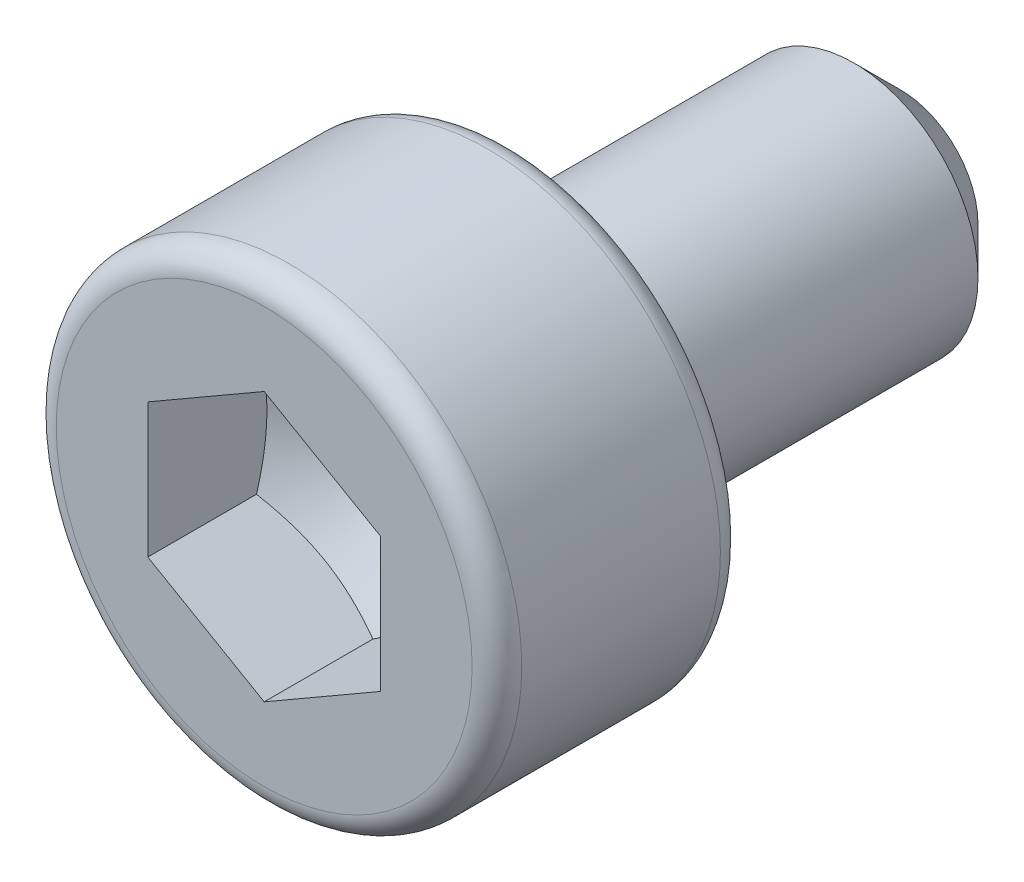
ISO-10303-21;
HEADER;
FILE_DESCRIPTION(('STEP AP214'),'2;1');
FILE_NAME('part.step','',(''),(''),'','','');
FILE_SCHEMA(('AUTOMOTIVE_DESIGN { 1 0 10303 214 1 1 1 1 }'));
ENDSEC;
DATA;
#1=APPLICATION_CONTEXT('core data for automotive mechanical design processes');
#2=APPLICATION_PROTOCOL_DEFINITION('international standard','automotive_design',2000,#1);
#3=PRODUCT_CONTEXT('',#1,'mechanical');
#4=PRODUCT('Part','Part','',(#3));
#5=PRODUCT_RELATED_PRODUCT_CATEGORY('part','',(#4));
#6=PRODUCT_DEFINITION_FORMATION('','',#4);
#7=PRODUCT_DEFINITION_CONTEXT('part definition',#1,'design');
#8=PRODUCT_DEFINITION('design','',#6,#7);
#9=PRODUCT_DEFINITION_SHAPE('','',#8);
#10=(LENGTH_UNIT() NAMED_UNIT(*) SI_UNIT(.MILLI.,.METRE.));
#11=(NAMED_UNIT(*) PLANE_ANGLE_UNIT() SI_UNIT($,.RADIAN.));
#12=(NAMED_UNIT(*) SI_UNIT($,.STERADIAN.) SOLID_ANGLE_UNIT());
#13=UNCERTAINTY_MEASURE_WITH_UNIT(LENGTH_MEASURE(1.E-05),#10,'distance_accuracy_value','');
#14=(GEOMETRIC_REPRESENTATION_CONTEXT(3) GLOBAL_UNCERTAINTY_ASSIGNED_CONTEXT((#13)) GLOBAL_UNIT_ASSIGNED_CONTEXT((#10,
#11,#12)) REPRESENTATION_CONTEXT('',''));
#15=CARTESIAN_POINT('',(0.,0.,0.));
#16=DIRECTION('',(0.,0.,1.));
#17=DIRECTION('',(1.,0.,0.));
#18=AXIS2_PLACEMENT_3D('',#15,#16,#17);
#19=CARTESIAN_POINT('',(0.75,0.433012701892214,-0.7));
#20=DIRECTION('',(0.5,0.866025403784439,0.));
#21=DIRECTION('',(-0.866025403784439,0.5,0.));
#22=AXIS2_PLACEMENT_3D('',#19,#20,#21);
#23=PLANE('',#22);
#24=CARTESIAN_POINT('',(0.7502,0.432897231838376,-0.700366099578617));
#25=CARTESIAN_POINT('',(0.717238666576004,0.451927466563569,-0.711360746831433));
#26=CARTESIAN_POINT('',(0.68399281869625,0.471121965786383,-0.721360638407276));
#27=CARTESIAN_POINT('',(0.616925218141244,0.509843463020717,-0.738817067650763));
#28=CARTESIAN_POINT('',(0.583102272153655,0.529371149991438,-0.746267427247854));
#29=CARTESIAN_POINT('',(0.515875632570364,0.568184468451565,-0.757867075837582));
#30=CARTESIAN_POINT('',(0.482482293499615,0.587464121753203,-0.762093531371977));
#31=CARTESIAN_POINT('',(0.415538173911307,0.626114327218175,-0.76714263363017));
#32=CARTESIAN_POINT('',(0.381987637355589,0.645484738530075,-0.767969457642672));
#33=CARTESIAN_POINT('',(0.319275698978885,0.681691493033268,-0.766266011537088));
#34=CARTESIAN_POINT('',(0.290104995811375,0.698533206359481,-0.764154000203301));
#35=CARTESIAN_POINT('',(0.231953671848459,0.732106888903204,-0.757454991772677));
#36=CARTESIAN_POINT('',(0.202973252776875,0.74883874165541,-0.752865697623372));
#37=CARTESIAN_POINT('',(0.144701650655193,0.782481866826474,-0.741390782696407));
#38=CARTESIAN_POINT('',(0.115417857581381,0.799388872640533,-0.734456431907052));
#39=CARTESIAN_POINT('',(0.057287489583832,0.83295045625201,-0.718717401982477));
#40=CARTESIAN_POINT('',(0.0284401676519287,0.849605465334794,-0.709916430390586));
#41=CARTESIAN_POINT('',(-0.000200000000000016,0.866140873838271,-0.700366099578618));
#42=B_SPLINE_CURVE_WITH_KNOTS('',3,(#24,#25,#26,#27,#28,#29,#30,#31,#32,#33,#34,#35,#36,#37,#38,
#39,#40,#41),.UNSPECIFIED.,.F.,.F.,(4,2,2,2,2,2,2,2,4),(0.,0.118896819359341,0.238079744533804,
0.3543117194564,0.470400831872514,0.571553114284104,0.672799351342654,0.776293900714048,
0.879584779344049),.UNSPECIFIED.);
#43=CARTESIAN_POINT('',(0.75,0.433012701892214,-0.700432779576839));
#44=VERTEX_POINT('',#43);
#45=CARTESIAN_POINT('',(0.,0.866025403784433,-0.700432779576841));
#46=VERTEX_POINT('',#45);
#47=EDGE_CURVE('E52',#44,#46,#42,.T.);
#48=ORIENTED_EDGE('',*,*,#47,.F.);
#49=DIRECTION('',(0.,0.,1.));
#50=VECTOR('',#49,1.);
#51=CARTESIAN_POINT('',(0.75,0.433012701892214,-0.7));
#52=LINE('',#51,#50);
#53=CARTESIAN_POINT('',(0.75,0.433012701892214,0.));
#54=VERTEX_POINT('',#53);
#55=EDGE_CURVE('E221',#44,#54,#52,.T.);
#56=ORIENTED_EDGE('',*,*,#55,.T.);
#57=DIRECTION('',(-0.866025403784439,0.5,0.));
#58=VECTOR('',#57,1.);
#59=CARTESIAN_POINT('',(0.75,0.433012701892214,0.));
#60=LINE('',#59,#58);
#61=CARTESIAN_POINT('',(0.,0.866025403784433,0.));
#62=VERTEX_POINT('',#61);
#63=EDGE_CURVE('E102',#54,#62,#60,.T.);
#64=ORIENTED_EDGE('',*,*,#63,.T.);
#65=DIRECTION('',(0.,0.,1.));
#66=VECTOR('',#65,1.);
#67=CARTESIAN_POINT('',(0.,0.866025403784433,-0.7));
#68=LINE('',#67,#66);
#69=EDGE_CURVE('E222',#46,#62,#68,.T.);
#70=ORIENTED_EDGE('',*,*,#69,.F.);
#71=EDGE_LOOP('',(#48,#56,#64,#70));
#72=FACE_BOUND('',#71,.T.);
#73=ADVANCED_FACE('F37',(#72),#23,.F.);
#74=CARTESIAN_POINT('',(0.75,-0.433012701892225,-0.7));
#75=DIRECTION('',(1.,0.,0.));
#76=DIRECTION('',(0.,1.,0.));
#77=AXIS2_PLACEMENT_3D('',#74,#75,#76);
#78=PLANE('',#77);
#79=CARTESIAN_POINT('',(0.75,-1.12155003345512,-0.421464556531514));
#80=CARTESIAN_POINT('',(0.75,-1.0891575863158,-0.437007760833722));
#81=CARTESIAN_POINT('',(0.75,-1.0566867101702,-0.452386791286091));
#82=CARTESIAN_POINT('',(0.75,-0.991545109192528,-0.482730542009868));
#83=CARTESIAN_POINT('',(0.75,-0.958874349677247,-0.497695187736947));
#84=CARTESIAN_POINT('',(0.75,-0.860122319737418,-0.542006550714751));
#85=CARTESIAN_POINT('',(0.75,-0.793688560891844,-0.570582270607276));
#86=CARTESIAN_POINT('',(0.75,-0.657750604094324,-0.625200540258185));
#87=CARTESIAN_POINT('',(0.75,-0.588211527649193,-0.65115746143929));
#88=CARTESIAN_POINT('',(0.75,-0.447342280020039,-0.697350174384806));
#89=CARTESIAN_POINT('',(0.75,-0.376017295183574,-0.717600819644571));
#90=CARTESIAN_POINT('',(0.75,-0.267595053569363,-0.741087338565405));
#91=CARTESIAN_POINT('',(0.75,-0.231252254589787,-0.747764688765423));
#92=CARTESIAN_POINT('',(0.75,-0.15815880213511,-0.758367954841571));
#93=CARTESIAN_POINT('',(0.75,-0.121408176416761,-0.762294056815491));
#94=CARTESIAN_POINT('',(0.75,-0.048143513360138,-0.767031193441621));
#95=CARTESIAN_POINT('',(0.75,-0.0116319194279316,-0.767878998462321));
#96=CARTESIAN_POINT('',(0.75,0.061330885556155,-0.766485938084743));
#97=CARTESIAN_POINT('',(0.75,0.0977820927322647,-0.764244881581513));
#98=CARTESIAN_POINT('',(0.75,0.18771472858449,-0.755102676497099));
#99=CARTESIAN_POINT('',(0.75,0.241022348242553,-0.746488069597163));
#100=CARTESIAN_POINT('',(0.75,0.346597186021325,-0.724270566086588));
#101=CARTESIAN_POINT('',(0.75,0.398863070071843,-0.710661658422512));
#102=CARTESIAN_POINT('',(0.75,0.503475749695101,-0.679558185145835));
#103=CARTESIAN_POINT('',(0.75,0.555798041750262,-0.661983277463112));
#104=CARTESIAN_POINT('',(0.75,0.659481603628858,-0.624296467544055));
#105=CARTESIAN_POINT('',(0.749999999999999,0.710843203382969,-0.604185455360141));
#106=CARTESIAN_POINT('',(0.749999999999999,0.841517438133812,-0.550432182430593));
#107=CARTESIAN_POINT('',(0.749999999999999,0.920310502489786,-0.515539069702119));
#108=CARTESIAN_POINT('',(0.749999999999999,1.07676574654142,-0.443300882841262));
#109=CARTESIAN_POINT('',(0.749999999999999,1.15442762953987,-0.405955179081599));
#110=CARTESIAN_POINT('',(0.749999999999999,1.30908252754072,-0.329689443703838));
#111=CARTESIAN_POINT('',(0.749999999999999,1.38607467053784,-0.290767650824091));
#112=CARTESIAN_POINT('',(0.749999999999999,1.53954340496616,-0.21191973582789));
#113=CARTESIAN_POINT('',(0.749999999999999,1.61601997925952,-0.17199358053249));
#114=CARTESIAN_POINT('',(0.749999999999999,1.76139915267478,-0.0952560505260022));
#115=CARTESIAN_POINT('',(0.749999999999999,1.8303346263369,-0.0585068223939873));
#116=CARTESIAN_POINT('',(0.749999999999999,1.96798380944957,0.0154101902594626));
#117=CARTESIAN_POINT('',(0.749999999999999,2.03669751056312,0.05257799028565));
#118=CARTESIAN_POINT('',(0.749999999999999,2.17377941736928,0.1271323530607));
#119=CARTESIAN_POINT('',(0.749999999999999,2.24214805728764,0.164518118346003));
#120=CARTESIAN_POINT('',(0.749999999999999,2.37874711178942,0.23953296786098));
#121=CARTESIAN_POINT('',(0.749999999999999,2.44697753342426,0.277162039245344));
#122=CARTESIAN_POINT('',(0.749999999999999,2.51515829702999,0.314880307887129));
#123=B_SPLINE_CURVE_WITH_KNOTS('',3,(#79,#80,#81,#82,#83,#84,#85,#86,#87,#88,#89,#90,#91,#92,
#93,#94,#95,#96,#97,#98,#99,#100,#101,#102,#103,#104,#105,#106,#107,#108,#109,#110,#111,#112,
#113,#114,#115,#116,#117,#118,#119,#120,#121,#122),.UNSPECIFIED.,.F.,.F.,(4,2,2,2,2,2,2,2,2,2,2,
2,2,2,2,2,2,2,2,2,2,4),(0.,0.10778396592653,0.215587196953586,0.432485275424467,
0.655046914009104,0.877023754828945,0.987790752529652,1.09855025709201,1.20798230045649,
1.31742111458229,1.47908393146278,1.64094196446713,1.80643212732748,1.9718643717858,
2.23030174361042,2.4888057226086,2.74760701145514,3.00641686101626,3.24077252120949,
3.47513689115394,3.70890481776016,3.94266050178766),.UNSPECIFIED.);
#124=CARTESIAN_POINT('',(0.75,-0.433012701892225,-0.700432779576836));
#125=VERTEX_POINT('',#124);
#126=EDGE_CURVE('E59',#125,#44,#123,.T.);
#127=ORIENTED_EDGE('',*,*,#126,.F.);
#128=DIRECTION('',(0.,0.,1.));
#129=VECTOR('',#128,1.);
#130=CARTESIAN_POINT('',(0.75,-0.433012701892225,-0.7));
#131=LINE('',#130,#129);
#132=CARTESIAN_POINT('',(0.75,-0.433012701892225,0.));
#133=VERTEX_POINT('',#132);
#134=EDGE_CURVE('E231',#125,#133,#131,.T.);
#135=ORIENTED_EDGE('',*,*,#134,.T.);
#136=DIRECTION('',(0.,1.,0.));
#137=VECTOR('',#136,1.);
#138=CARTESIAN_POINT('',(0.75,-0.433012701892225,0.));
#139=LINE('',#138,#137);
#140=EDGE_CURVE('E225',#133,#54,#139,.T.);
#141=ORIENTED_EDGE('',*,*,#140,.T.);
#142=ORIENTED_EDGE('',*,*,#55,.F.);
#143=EDGE_LOOP('',(#127,#135,#141,#142));
#144=FACE_BOUND('',#143,.T.);
#145=ADVANCED_FACE('F123',(#144),#78,.F.);
#146=CARTESIAN_POINT('',(0.,-0.866025403784444,-0.7));
#147=DIRECTION('',(0.5,-0.866025403784439,0.));
#148=DIRECTION('',(0.866025403784439,0.5,0.));
#149=AXIS2_PLACEMENT_3D('',#146,#147,#148);
#150=PLANE('',#149);
#151=CARTESIAN_POINT('',(-0.000200000000000435,-0.866140873838282,-0.700366099578612));
#152=CARTESIAN_POINT('',(0.0327613334239954,-0.847110639113089,-0.711360746831429));
#153=CARTESIAN_POINT('',(0.0660071813037501,-0.827916139890275,-0.721360638407271));
#154=CARTESIAN_POINT('',(0.133074781858756,-0.78919464265594,-0.738817067650758));
#155=CARTESIAN_POINT('',(0.166897727846346,-0.769666955685219,-0.74626742724785));
#156=CARTESIAN_POINT('',(0.234124367429638,-0.730853637225091,-0.757867075837577));
#157=CARTESIAN_POINT('',(0.267517706500387,-0.711573983923454,-0.762093531371972));
#158=CARTESIAN_POINT('',(0.334461826088695,-0.672923778458482,-0.767142633630165));
#159=CARTESIAN_POINT('',(0.368012362644414,-0.653553367146581,-0.767969457642667));
#160=CARTESIAN_POINT('',(0.430724301021118,-0.617346612643388,-0.766266011537082));
#161=CARTESIAN_POINT('',(0.459895004188627,-0.600504899317176,-0.764154000203295));
#162=CARTESIAN_POINT('',(0.518046328151544,-0.566931216773453,-0.757454991772672));
#163=CARTESIAN_POINT('',(0.547026747223126,-0.550199364021247,-0.752865697623366));
#164=CARTESIAN_POINT('',(0.605298349344808,-0.516556238850183,-0.741390782696401));
#165=CARTESIAN_POINT('',(0.63458214241862,-0.499649233036124,-0.734456431907047));
#166=CARTESIAN_POINT('',(0.692712510416168,-0.466087649424648,-0.718717401982472));
#167=CARTESIAN_POINT('',(0.721559832348071,-0.449432640341864,-0.709916430390581));
#168=CARTESIAN_POINT('',(0.7502,-0.432897231838387,-0.700366099578614));
#169=B_SPLINE_CURVE_WITH_KNOTS('',3,(#151,#152,#153,#154,#155,#156,#157,#158,#159,#160,#161,
#162,#163,#164,#165,#166,#167,#168),.UNSPECIFIED.,.F.,.F.,(4,2,2,2,2,2,2,2,4),(0.,
0.118896819359342,0.238079744533807,0.354311719456403,0.470400831872518,0.571553114284107,
0.672799351342657,0.776293900714049,0.87958477934405),.UNSPECIFIED.);
#170=CARTESIAN_POINT('',(0.,-0.866025403784444,-0.700432779576834));
#171=VERTEX_POINT('',#170);
#172=EDGE_CURVE('E100',#171,#125,#169,.T.);
#173=ORIENTED_EDGE('',*,*,#172,.F.);
#174=DIRECTION('',(0.,0.,1.));
#175=VECTOR('',#174,1.);
#176=CARTESIAN_POINT('',(0.,-0.866025403784444,-0.7));
#177=LINE('',#176,#175);
#178=CARTESIAN_POINT('',(0.,-0.866025403784444,0.));
#179=VERTEX_POINT('',#178);
#180=EDGE_CURVE('E229',#171,#179,#177,.T.);
#181=ORIENTED_EDGE('',*,*,#180,.T.);
#182=DIRECTION('',(0.866025403784439,0.5,0.));
#183=VECTOR('',#182,1.);
#184=CARTESIAN_POINT('',(0.,-0.866025403784444,0.));
#185=LINE('',#184,#183);
#186=EDGE_CURVE('E236',#179,#133,#185,.T.);
#187=ORIENTED_EDGE('',*,*,#186,.T.);
#188=ORIENTED_EDGE('',*,*,#134,.F.);
#189=EDGE_LOOP('',(#173,#181,#187,#188));
#190=FACE_BOUND('',#189,.T.);
#191=ADVANCED_FACE('F155',(#190),#150,.F.);
#192=CARTESIAN_POINT('',(-0.75,-0.433012701892225,-0.7));
#193=DIRECTION('',(-0.5,-0.866025403784439,0.));
#194=DIRECTION('',(0.866025403784439,-0.5,0.));
#195=AXIS2_PLACEMENT_3D('',#192,#193,#194);
#196=PLANE('',#195);
#197=CARTESIAN_POINT('',(-0.7502,-0.432897231838387,-0.700366099578614));
#198=CARTESIAN_POINT('',(-0.717238666576004,-0.45192746656358,-0.71136074683143));
#199=CARTESIAN_POINT('',(-0.68399281869625,-0.471121965786393,-0.721360638407272));
#200=CARTESIAN_POINT('',(-0.616925218141244,-0.509843463020728,-0.738817067650759));
#201=CARTESIAN_POINT('',(-0.583102272153654,-0.52937114999145,-0.74626742724785));
#202=CARTESIAN_POINT('',(-0.515875632570362,-0.568184468451577,-0.757867075837577));
#203=CARTESIAN_POINT('',(-0.482482293499613,-0.587464121753214,-0.762093531371973));
#204=CARTESIAN_POINT('',(-0.415538173911305,-0.626114327218186,-0.767142633630165));
#205=CARTESIAN_POINT('',(-0.381987637355586,-0.645484738530087,-0.767969457642667));
#206=CARTESIAN_POINT('',(-0.319275698978882,-0.68169149303328,-0.766266011537082));
#207=CARTESIAN_POINT('',(-0.290104995811373,-0.698533206359493,-0.764154000203295));
#208=CARTESIAN_POINT('',(-0.231953671848457,-0.732106888903215,-0.757454991772671));
#209=CARTESIAN_POINT('',(-0.202973252776874,-0.748838741655422,-0.752865697623366));
#210=CARTESIAN_POINT('',(-0.144701650655192,-0.782481866826485,-0.7413907826964));
#211=CARTESIAN_POINT('',(-0.11541785758138,-0.799388872640544,-0.734456431907045));
#212=CARTESIAN_POINT('',(-0.0572874895838315,-0.832950456252021,-0.718717401982471));
#213=CARTESIAN_POINT('',(-0.0284401676519284,-0.849605465334805,-0.70991643039058));
#214=CARTESIAN_POINT('',(0.000200000000000073,-0.866140873838282,-0.700366099578612));
#215=B_SPLINE_CURVE_WITH_KNOTS('',3,(#197,#198,#199,#200,#201,#202,#203,#204,#205,#206,#207,
#208,#209,#210,#211,#212,#213,#214),.UNSPECIFIED.,.F.,.F.,(4,2,2,2,2,2,2,2,4),(0.,
0.118896819359341,0.238079744533806,0.354311719456402,0.470400831872517,0.571553114284106,
0.672799351342656,0.776293900714049,0.87958477934405),.UNSPECIFIED.);
#216=CARTESIAN_POINT('',(-0.75,-0.433012701892225,-0.700432779576836));
#217=VERTEX_POINT('',#216);
#218=EDGE_CURVE('E104',#217,#171,#215,.T.);
#219=ORIENTED_EDGE('',*,*,#218,.F.);
#220=DIRECTION('',(0.,0.,1.));
#221=VECTOR('',#220,1.);
#222=CARTESIAN_POINT('',(-0.75,-0.433012701892225,-0.7));
#223=LINE('',#222,#221);
#224=CARTESIAN_POINT('',(-0.75,-0.433012701892225,0.));
#225=VERTEX_POINT('',#224);
#226=EDGE_CURVE('E227',#217,#225,#223,.T.);
#227=ORIENTED_EDGE('',*,*,#226,.T.);
#228=DIRECTION('',(0.866025403784439,-0.5,0.));
#229=VECTOR('',#228,1.);
#230=CARTESIAN_POINT('',(-0.75,-0.433012701892225,0.));
#231=LINE('',#230,#229);
#232=EDGE_CURVE('E239',#225,#179,#231,.T.);
#233=ORIENTED_EDGE('',*,*,#232,.T.);
#234=ORIENTED_EDGE('',*,*,#180,.F.);
#235=EDGE_LOOP('',(#219,#227,#233,#234));
#236=FACE_BOUND('',#235,.T.);
#237=ADVANCED_FACE('F151',(#236),#196,.F.);
#238=CARTESIAN_POINT('',(-0.75,0.433012701892214,-0.7));
#239=DIRECTION('',(-1.,0.,0.));
#240=DIRECTION('',(0.,-1.,0.));
#241=AXIS2_PLACEMENT_3D('',#238,#239,#240);
#242=PLANE('',#241);
#243=CARTESIAN_POINT('',(-0.75,-1.12155003345512,-0.421464556531514));
#244=CARTESIAN_POINT('',(-0.75,-1.0891575863158,-0.437007760833722));
#245=CARTESIAN_POINT('',(-0.75,-1.0566867101702,-0.452386791286091));
#246=CARTESIAN_POINT('',(-0.75,-0.991545109192528,-0.482730542009868));
#247=CARTESIAN_POINT('',(-0.75,-0.958874349677247,-0.497695187736947));
#248=CARTESIAN_POINT('',(-0.75,-0.860122319737418,-0.542006550714751));
#249=CARTESIAN_POINT('',(-0.75,-0.793688560891843,-0.570582270607276));
#250=CARTESIAN_POINT('',(-0.75,-0.657750604094323,-0.625200540258185));
#251=CARTESIAN_POINT('',(-0.75,-0.588211527649193,-0.65115746143929));
#252=CARTESIAN_POINT('',(-0.75,-0.447342280020039,-0.697350174384806));
#253=CARTESIAN_POINT('',(-0.75,-0.376017295183574,-0.717600819644571));
#254=CARTESIAN_POINT('',(-0.75,-0.267595053569363,-0.741087338565405));
#255=CARTESIAN_POINT('',(-0.75,-0.231252254589787,-0.747764688765423));
#256=CARTESIAN_POINT('',(-0.75,-0.15815880213511,-0.758367954841571));
#257=CARTESIAN_POINT('',(-0.75,-0.12140817641676,-0.762294056815491));
#258=CARTESIAN_POINT('',(-0.75,-0.0481435133601379,-0.76703119344162));
#259=CARTESIAN_POINT('',(-0.75,-0.0116319194279313,-0.767878998462321));
#260=CARTESIAN_POINT('',(-0.75,0.0613308855561553,-0.766485938084743));
#261=CARTESIAN_POINT('',(-0.75,0.097782092732265,-0.764244881581513));
#262=CARTESIAN_POINT('',(-0.75,0.18771472858449,-0.755102676497099));
#263=CARTESIAN_POINT('',(-0.75,0.241022348242553,-0.746488069597163));
#264=CARTESIAN_POINT('',(-0.75,0.346597186021325,-0.724270566086588));
#265=CARTESIAN_POINT('',(-0.75,0.398863070071843,-0.710661658422512));
#266=CARTESIAN_POINT('',(-0.75,0.503475749695102,-0.679558185145835));
#267=CARTESIAN_POINT('',(-0.75,0.555798041750263,-0.661983277463112));
#268=CARTESIAN_POINT('',(-0.75,0.659481603628858,-0.624296467544055));
#269=CARTESIAN_POINT('',(-0.75,0.710843203382969,-0.604185455360141));
#270=CARTESIAN_POINT('',(-0.75,0.841517438133812,-0.550432182430593));
#271=CARTESIAN_POINT('',(-0.75,0.920310502489786,-0.515539069702119));
#272=CARTESIAN_POINT('',(-0.75,1.07676574654142,-0.443300882841262));
#273=CARTESIAN_POINT('',(-0.75,1.15442762953987,-0.405955179081599));
#274=CARTESIAN_POINT('',(-0.75,1.30908252754072,-0.329689443703838));
#275=CARTESIAN_POINT('',(-0.75,1.38607467053784,-0.290767650824091));
#276=CARTESIAN_POINT('',(-0.75,1.53954340496616,-0.211919735827891));
#277=CARTESIAN_POINT('',(-0.749999999999999,1.61601997925952,-0.17199358053249));
#278=CARTESIAN_POINT('',(-0.749999999999999,1.76139915267478,-0.0952560505260029));
#279=CARTESIAN_POINT('',(-0.749999999999999,1.8303346263369,-0.058506822393988));
#280=CARTESIAN_POINT('',(-0.749999999999999,1.96798380944957,0.0154101902594622));
#281=CARTESIAN_POINT('',(-0.749999999999999,2.03669751056312,0.0525779902856498));
#282=CARTESIAN_POINT('',(-0.749999999999999,2.17377941736928,0.1271323530607));
#283=CARTESIAN_POINT('',(-0.749999999999999,2.24214805728764,0.164518118346003));
#284=CARTESIAN_POINT('',(-0.749999999999999,2.37874711178941,0.23953296786098));
#285=CARTESIAN_POINT('',(-0.749999999999999,2.44697753342426,0.277162039245344));
#286=CARTESIAN_POINT('',(-0.749999999999999,2.51515829702999,0.314880307887129));
#287=B_SPLINE_CURVE_WITH_KNOTS('',3,(#243,#244,#245,#246,#247,#248,#249,#250,#251,#252,#253,
#254,#255,#256,#257,#258,#259,#260,#261,#262,#263,#264,#265,#266,#267,#268,#269,#270,#271,#272,
#273,#274,#275,#276,#277,#278,#279,#280,#281,#282,#283,#284,#285,#286),.UNSPECIFIED.,.F.,.F.,(4,
2,2,2,2,2,2,2,2,2,2,2,2,2,2,2,2,2,2,2,2,4),(0.,0.10778396592653,0.215587196953586,
0.432485275424467,0.655046914009104,0.877023754828945,0.987790752529652,1.09855025709201,
1.20798230045649,1.31742111458229,1.47908393146278,1.64094196446713,1.80643212732748,
1.9718643717858,2.23030174361042,2.48880572260859,2.74760701145514,3.00641686101626,
3.24077252120949,3.47513689115394,3.70890481776016,3.94266050178766),.UNSPECIFIED.);
#288=CARTESIAN_POINT('',(-0.75,0.433012701892214,-0.700432779576839));
#289=VERTEX_POINT('',#288);
#290=EDGE_CURVE('E139',#289,#217,#287,.F.);
#291=ORIENTED_EDGE('',*,*,#290,.F.);
#292=DIRECTION('',(0.,0.,1.));
#293=VECTOR('',#292,1.);
#294=CARTESIAN_POINT('',(-0.75,0.433012701892214,-0.7));
#295=LINE('',#294,#293);
#296=CARTESIAN_POINT('',(-0.75,0.433012701892214,0.));
#297=VERTEX_POINT('',#296);
#298=EDGE_CURVE('E224',#289,#297,#295,.T.);
#299=ORIENTED_EDGE('',*,*,#298,.T.);
#300=DIRECTION('',(0.,-1.,0.));
#301=VECTOR('',#300,1.);
#302=CARTESIAN_POINT('',(-0.75,0.433012701892214,0.));
#303=LINE('',#302,#301);
#304=EDGE_CURVE('E242',#297,#225,#303,.T.);
#305=ORIENTED_EDGE('',*,*,#304,.T.);
#306=ORIENTED_EDGE('',*,*,#226,.F.);
#307=EDGE_LOOP('',(#291,#299,#305,#306));
#308=FACE_BOUND('',#307,.T.);
#309=ADVANCED_FACE('F154',(#308),#242,.F.);
#310=CARTESIAN_POINT('',(0.,0.866025403784433,-0.7));
#311=DIRECTION('',(-0.5,0.866025403784439,0.));
#312=DIRECTION('',(-0.866025403784439,-0.5,0.));
#313=AXIS2_PLACEMENT_3D('',#310,#311,#312);
#314=PLANE('',#313);
#315=CARTESIAN_POINT('',(0.000200000000000009,0.866140873838271,-0.700366099578618));
#316=CARTESIAN_POINT('',(-0.0327613334239954,0.847110639113078,-0.711360746831434));
#317=CARTESIAN_POINT('',(-0.0660071813037497,0.827916139890265,-0.721360638407277));
#318=CARTESIAN_POINT('',(-0.133074781858755,0.78919464265593,-0.738817067650764));
#319=CARTESIAN_POINT('',(-0.166897727846345,0.769666955685209,-0.746267427247855));
#320=CARTESIAN_POINT('',(-0.234124367429636,0.730853637225082,-0.757867075837582));
#321=CARTESIAN_POINT('',(-0.267517706500384,0.711573983923445,-0.762093531371977));
#322=CARTESIAN_POINT('',(-0.334461826088692,0.672923778458473,-0.76714263363017));
#323=CARTESIAN_POINT('',(-0.36801236264441,0.653553367146573,-0.767969457642672));
#324=CARTESIAN_POINT('',(-0.430724301021114,0.61734661264338,-0.766266011537088));
#325=CARTESIAN_POINT('',(-0.459895004188624,0.600504899317168,-0.7641540002033));
#326=CARTESIAN_POINT('',(-0.51804632815154,0.566931216773444,-0.757454991772677));
#327=CARTESIAN_POINT('',(-0.547026747223124,0.550199364021238,-0.752865697623371));
#328=CARTESIAN_POINT('',(-0.605298349344806,0.516556238850174,-0.741390782696406));
#329=CARTESIAN_POINT('',(-0.634582142418619,0.499649233036115,-0.734456431907051));
#330=CARTESIAN_POINT('',(-0.692712510416168,0.466087649424638,-0.718717401982476));
#331=CARTESIAN_POINT('',(-0.721559832348071,0.449432640341853,-0.709916430390585));
#332=CARTESIAN_POINT('',(-0.7502,0.432897231838376,-0.700366099578617));
#333=B_SPLINE_CURVE_WITH_KNOTS('',3,(#315,#316,#317,#318,#319,#320,#321,#322,#323,#324,#325,
#326,#327,#328,#329,#330,#331,#332),.UNSPECIFIED.,.F.,.F.,(4,2,2,2,2,2,2,2,4),(0.,
0.11889681935934,0.238079744533804,0.354311719456399,0.470400831872512,0.571553114284103,
0.672799351342654,0.776293900714048,0.87958477934405),.UNSPECIFIED.);
#334=EDGE_CURVE('E129',#46,#289,#333,.T.);
#335=ORIENTED_EDGE('',*,*,#334,.F.);
#336=ORIENTED_EDGE('',*,*,#69,.T.);
#337=DIRECTION('',(-0.866025403784439,-0.5,0.));
#338=VECTOR('',#337,1.);
#339=CARTESIAN_POINT('',(0.,0.866025403784433,0.));
#340=LINE('',#339,#338);
#341=EDGE_CURVE('E245',#62,#297,#340,.T.);
#342=ORIENTED_EDGE('',*,*,#341,.T.);
#343=ORIENTED_EDGE('',*,*,#298,.F.);
#344=EDGE_LOOP('',(#335,#336,#342,#343));
#345=FACE_BOUND('',#344,.T.);
#346=ADVANCED_FACE('F160',(#345),#314,.F.);
#347=CARTESIAN_POINT('',(0.,0.,0.));
#348=DIRECTION('',(0.,0.,-1.));
#349=DIRECTION('',(-1.,0.,0.));
#350=AXIS2_PLACEMENT_3D('',#347,#348,#349);
#351=PLANE('',#350);
#352=ORIENTED_EDGE('',*,*,#341,.F.);
#353=ORIENTED_EDGE('',*,*,#63,.F.);
#354=ORIENTED_EDGE('',*,*,#140,.F.);
#355=ORIENTED_EDGE('',*,*,#186,.F.);
#356=ORIENTED_EDGE('',*,*,#232,.F.);
#357=ORIENTED_EDGE('',*,*,#304,.F.);
#358=EDGE_LOOP('',(#352,#353,#354,#355,#356,#357));
#359=FACE_BOUND('',#358,.T.);
#360=CARTESIAN_POINT('',(0.,0.,0.));
#361=DIRECTION('',(0.,0.,-1.));
#362=DIRECTION('',(-1.,0.,0.));
#363=AXIS2_PLACEMENT_3D('',#360,#361,#362);
#364=CIRCLE('',#363,1.34);
#365=CARTESIAN_POINT('',(-1.34,0.,0.));
#366=VERTEX_POINT('',#365);
#367=EDGE_CURVE('E205',#366,#366,#364,.F.);
#368=ORIENTED_EDGE('',*,*,#367,.T.);
#369=EDGE_LOOP('',(#368));
#370=FACE_BOUND('',#369,.T.);
#371=ADVANCED_FACE('F164',(#359,#370),#351,.F.);
#372=CARTESIAN_POINT('',(0.,0.,0.));
#373=DIRECTION('',(0.,0.,1.));
#374=DIRECTION('',(1.,0.,0.));
#375=AXIS2_PLACEMENT_3D('',#372,#373,#374);
#376=CYLINDRICAL_SURFACE('',#375,1.5);
#377=CARTESIAN_POINT('',(0.,0.,-1.44));
#378=DIRECTION('',(0.,0.,1.));
#379=DIRECTION('',(1.,0.,0.));
#380=AXIS2_PLACEMENT_3D('',#377,#378,#379);
#381=CIRCLE('',#380,1.5);
#382=CARTESIAN_POINT('',(1.5,0.,-1.44));
#383=VERTEX_POINT('',#382);
#384=EDGE_CURVE('E209',#383,#383,#381,.T.);
#385=ORIENTED_EDGE('',*,*,#384,.T.);
#386=EDGE_LOOP('',(#385));
#387=FACE_BOUND('',#386,.T.);
#388=CARTESIAN_POINT('',(0.,0.,-0.16));
#389=DIRECTION('',(0.,0.,-1.));
#390=DIRECTION('',(-1.,0.,0.));
#391=AXIS2_PLACEMENT_3D('',#388,#389,#390);
#392=CIRCLE('',#391,1.5);
#393=CARTESIAN_POINT('',(-1.5,0.,-0.16));
#394=VERTEX_POINT('',#393);
#395=EDGE_CURVE('E202',#394,#394,#392,.T.);
#396=ORIENTED_EDGE('',*,*,#395,.T.);
#397=EDGE_LOOP('',(#396));
#398=FACE_BOUND('',#397,.T.);
#399=ADVANCED_FACE('F181',(#387,#398),#376,.T.);
#400=CARTESIAN_POINT('',(0.,1.5,-1.6));
#401=DIRECTION('',(0.,0.,1.));
#402=DIRECTION('',(1.,0.,0.));
#403=AXIS2_PLACEMENT_3D('',#400,#401,#402);
#404=PLANE('',#403);
#405=CARTESIAN_POINT('',(0.,0.,-1.6));
#406=DIRECTION('',(0.,0.,1.));
#407=DIRECTION('',(1.,0.,0.));
#408=AXIS2_PLACEMENT_3D('',#405,#406,#407);
#409=CIRCLE('',#408,0.9);
#410=CARTESIAN_POINT('',(0.9,0.,-1.6));
#411=VERTEX_POINT('',#410);
#412=EDGE_CURVE('E45',#411,#411,#409,.T.);
#413=ORIENTED_EDGE('',*,*,#412,.T.);
#414=EDGE_LOOP('',(#413));
#415=FACE_BOUND('',#414,.T.);
#416=CARTESIAN_POINT('',(0.,0.,-1.6));
#417=DIRECTION('',(0.,0.,1.));
#418=DIRECTION('',(1.,0.,0.));
#419=AXIS2_PLACEMENT_3D('',#416,#417,#418);
#420=CIRCLE('',#419,1.34);
#421=CARTESIAN_POINT('',(1.34,0.,-1.6));
#422=VERTEX_POINT('',#421);
#423=EDGE_CURVE('E207',#422,#422,#420,.F.);
#424=ORIENTED_EDGE('',*,*,#423,.T.);
#425=EDGE_LOOP('',(#424));
#426=FACE_BOUND('',#425,.T.);
#427=ADVANCED_FACE('F177',(#415,#426),#404,.F.);
#428=CARTESIAN_POINT('',(0.,0.,0.));
#429=DIRECTION('',(0.,0.,1.));
#430=DIRECTION('',(1.,0.,0.));
#431=AXIS2_PLACEMENT_3D('',#428,#429,#430);
#432=CYLINDRICAL_SURFACE('',#431,0.8);
#433=CARTESIAN_POINT('',(0.,0.,-1.7));
#434=DIRECTION('',(0.,0.,1.));
#435=DIRECTION('',(1.,0.,0.));
#436=AXIS2_PLACEMENT_3D('',#433,#434,#435);
#437=CIRCLE('',#436,0.8);
#438=CARTESIAN_POINT('',(0.8,0.,-1.7));
#439=VERTEX_POINT('',#438);
#440=EDGE_CURVE('E11',#439,#439,#437,.F.);
#441=ORIENTED_EDGE('',*,*,#440,.T.);
#442=EDGE_LOOP('',(#441));
#443=FACE_BOUND('',#442,.T.);
#444=CARTESIAN_POINT('',(0.,0.,-3.8));
#445=DIRECTION('',(0.,0.,1.));
#446=DIRECTION('',(1.,0.,0.));
#447=AXIS2_PLACEMENT_3D('',#444,#445,#446);
#448=CIRCLE('',#447,0.8);
#449=CARTESIAN_POINT('',(0.8,0.,-3.8));
#450=VERTEX_POINT('',#449);
#451=EDGE_CURVE('E218',#450,#450,#448,.T.);
#452=ORIENTED_EDGE('',*,*,#451,.T.);
#453=EDGE_LOOP('',(#452));
#454=FACE_BOUND('',#453,.T.);
#455=ADVANCED_FACE('F173',(#443,#454),#432,.T.);
#456=CARTESIAN_POINT('',(0.,0.8,-4.1));
#457=DIRECTION('',(0.,0.,1.));
#458=DIRECTION('',(1.,0.,0.));
#459=AXIS2_PLACEMENT_3D('',#456,#457,#458);
#460=PLANE('',#459);
#461=CARTESIAN_POINT('',(0.,0.,-4.1));
#462=DIRECTION('',(0.,0.,1.));
#463=DIRECTION('',(1.,0.,0.));
#464=AXIS2_PLACEMENT_3D('',#461,#462,#463);
#465=CIRCLE('',#464,0.499999999999999);
#466=CARTESIAN_POINT('',(0.499999999999999,0.,-4.1));
#467=VERTEX_POINT('',#466);
#468=EDGE_CURVE('E215',#467,#467,#465,.F.);
#469=ORIENTED_EDGE('',*,*,#468,.T.);
#470=EDGE_LOOP('',(#469));
#471=FACE_BOUND('',#470,.T.);
#472=ADVANCED_FACE('F169',(#471),#460,.F.);
#473=CARTESIAN_POINT('',(0.,0.,-3.8));
#474=DIRECTION('',(0.,0.,1.));
#475=DIRECTION('',(1.,0.,0.));
#476=AXIS2_PLACEMENT_3D('',#473,#474,#475);
#477=CONICAL_SURFACE('',#476,0.8,0.785398163397449);
#478=ORIENTED_EDGE('',*,*,#468,.F.);
#479=EDGE_LOOP('',(#478));
#480=FACE_BOUND('',#479,.T.);
#481=ORIENTED_EDGE('',*,*,#451,.F.);
#482=EDGE_LOOP('',(#481));
#483=FACE_BOUND('',#482,.T.);
#484=ADVANCED_FACE('F172',(#480,#483),#477,.T.);
#485=CARTESIAN_POINT('',(0.,0.,-1.44));
#486=DIRECTION('',(0.,0.,1.));
#487=DIRECTION('',(1.,0.,0.));
#488=AXIS2_PLACEMENT_3D('',#485,#486,#487);
#489=TOROIDAL_SURFACE('',#488,1.34,0.16);
#490=ORIENTED_EDGE('',*,*,#423,.F.);
#491=EDGE_LOOP('',(#490));
#492=FACE_BOUND('',#491,.T.);
#493=ORIENTED_EDGE('',*,*,#384,.F.);
#494=EDGE_LOOP('',(#493));
#495=FACE_BOUND('',#494,.T.);
#496=ADVANCED_FACE('F191',(#492,#495),#489,.T.);
#497=CARTESIAN_POINT('',(0.,0.,-0.16));
#498=DIRECTION('',(0.,0.,-1.));
#499=DIRECTION('',(-1.,0.,0.));
#500=AXIS2_PLACEMENT_3D('',#497,#498,#499);
#501=TOROIDAL_SURFACE('',#500,1.34,0.16);
#502=ORIENTED_EDGE('',*,*,#395,.F.);
#503=EDGE_LOOP('',(#502));
#504=FACE_BOUND('',#503,.T.);
#505=ORIENTED_EDGE('',*,*,#367,.F.);
#506=EDGE_LOOP('',(#505));
#507=FACE_BOUND('',#506,.T.);
#508=ADVANCED_FACE('F95',(#504,#507),#501,.T.);
#509=CARTESIAN_POINT('',(0.,0.,-0.7));
#510=DIRECTION('',(0.,0.,1.));
#511=DIRECTION('',(1.,0.,0.));
#512=AXIS2_PLACEMENT_3D('',#509,#510,#511);
#513=CONICAL_SURFACE('',#512,0.866775,1.0471975511966);
#514=CARTESIAN_POINT('',(0.,0.,-1.20043277957684));
#515=VERTEX_POINT('',#514);
#516=VERTEX_LOOP('',#515);
#517=FACE_BOUND('',#516,.T.);
#518=ORIENTED_EDGE('',*,*,#126,.T.);
#519=ORIENTED_EDGE('',*,*,#47,.T.);
#520=ORIENTED_EDGE('',*,*,#334,.T.);
#521=ORIENTED_EDGE('',*,*,#290,.T.);
#522=ORIENTED_EDGE('',*,*,#218,.T.);
#523=ORIENTED_EDGE('',*,*,#172,.T.);
#524=EDGE_LOOP('',(#518,#519,#520,#521,#522,#523));
#525=FACE_BOUND('',#524,.T.);
#526=ADVANCED_FACE('F92',(#517,#525),#513,.F.);
#527=CARTESIAN_POINT('',(0.,0.,-1.7));
#528=DIRECTION('',(0.,0.,1.));
#529=DIRECTION('',(1.,0.,0.));
#530=AXIS2_PLACEMENT_3D('',#527,#528,#529);
#531=TOROIDAL_SURFACE('',#530,0.9,0.1);
#532=ORIENTED_EDGE('',*,*,#440,.F.);
#533=EDGE_LOOP('',(#532));
#534=FACE_BOUND('',#533,.T.);
#535=ORIENTED_EDGE('',*,*,#412,.F.);
#536=EDGE_LOOP('',(#535));
#537=FACE_BOUND('',#536,.T.);
#538=ADVANCED_FACE('F39',(#534,#537),#531,.F.);
#539=CLOSED_SHELL('',(#73,#145,#191,#237,#309,#346,#371,#399,#427,#455,#472,#484,#496,#508,#526,#538));
#540=MANIFOLD_SOLID_BREP('B2',#539);
#541=ADVANCED_BREP_SHAPE_REPRESENTATION('',(#18,#540),#14);
#542=SHAPE_DEFINITION_REPRESENTATION(#9,#541);
ENDSEC;
END-ISO-10303-21;
